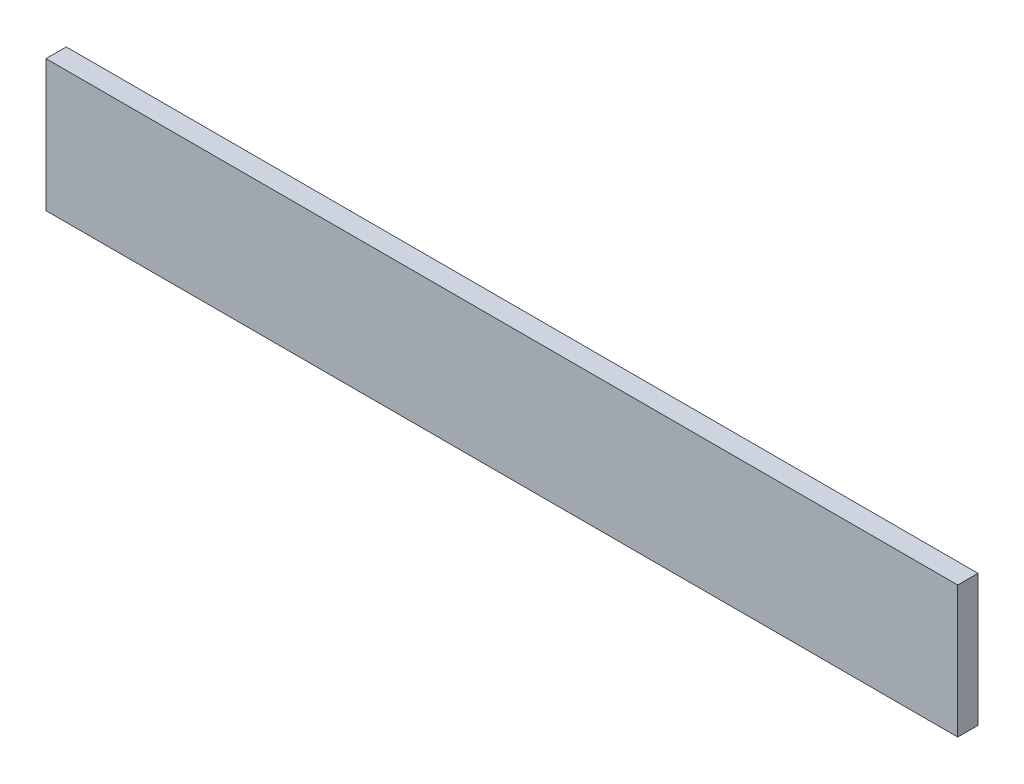
ISO-10303-21;
HEADER;
FILE_DESCRIPTION(('STEP AP214'),'2;1');
FILE_NAME('part.step','',(''),(''),'','','');
FILE_SCHEMA(('AUTOMOTIVE_DESIGN { 1 0 10303 214 1 1 1 1 }'));
ENDSEC;
DATA;
#1=APPLICATION_CONTEXT('core data for automotive mechanical design processes');
#2=APPLICATION_PROTOCOL_DEFINITION('international standard','automotive_design',2000,#1);
#3=PRODUCT_CONTEXT('',#1,'mechanical');
#4=PRODUCT('Part','Part','',(#3));
#5=PRODUCT_RELATED_PRODUCT_CATEGORY('part','',(#4));
#6=PRODUCT_DEFINITION_FORMATION('','',#4);
#7=PRODUCT_DEFINITION_CONTEXT('part definition',#1,'design');
#8=PRODUCT_DEFINITION('design','',#6,#7);
#9=PRODUCT_DEFINITION_SHAPE('','',#8);
#10=(LENGTH_UNIT() NAMED_UNIT(*) SI_UNIT(.MILLI.,.METRE.));
#11=(NAMED_UNIT(*) PLANE_ANGLE_UNIT() SI_UNIT($,.RADIAN.));
#12=(NAMED_UNIT(*) SI_UNIT($,.STERADIAN.) SOLID_ANGLE_UNIT());
#13=UNCERTAINTY_MEASURE_WITH_UNIT(LENGTH_MEASURE(1.E-05),#10,'distance_accuracy_value','');
#14=(GEOMETRIC_REPRESENTATION_CONTEXT(3) GLOBAL_UNCERTAINTY_ASSIGNED_CONTEXT((#13)) GLOBAL_UNIT_ASSIGNED_CONTEXT((#10,
#11,#12)) REPRESENTATION_CONTEXT('',''));
#15=CARTESIAN_POINT('',(0.,0.,0.));
#16=DIRECTION('',(0.,0.,1.));
#17=DIRECTION('',(1.,0.,0.));
#18=AXIS2_PLACEMENT_3D('',#15,#16,#17);
#19=CARTESIAN_POINT('',(0.,0.,10.));
#20=DIRECTION('',(1.,0.,0.));
#21=DIRECTION('',(0.,1.,0.));
#22=AXIS2_PLACEMENT_3D('',#19,#20,#21);
#23=PLANE('',#22);
#24=DIRECTION('',(0.,-1.,0.));
#25=VECTOR('',#24,1.);
#26=CARTESIAN_POINT('',(0.,0.,0.));
#27=LINE('',#26,#25);
#28=CARTESIAN_POINT('',(0.,65.,0.));
#29=VERTEX_POINT('',#28);
#30=CARTESIAN_POINT('',(0.,0.,0.));
#31=VERTEX_POINT('',#30);
#32=EDGE_CURVE('E96',#29,#31,#27,.T.);
#33=ORIENTED_EDGE('',*,*,#32,.T.);
#34=DIRECTION('',(0.,0.,-1.));
#35=VECTOR('',#34,1.);
#36=CARTESIAN_POINT('',(0.,0.,10.));
#37=LINE('',#36,#35);
#38=CARTESIAN_POINT('',(0.,0.,10.));
#39=VERTEX_POINT('',#38);
#40=EDGE_CURVE('E11',#39,#31,#37,.T.);
#41=ORIENTED_EDGE('',*,*,#40,.F.);
#42=DIRECTION('',(0.,-1.,0.));
#43=VECTOR('',#42,1.);
#44=CARTESIAN_POINT('',(0.,0.,10.));
#45=LINE('',#44,#43);
#46=CARTESIAN_POINT('',(0.,65.,10.));
#47=VERTEX_POINT('',#46);
#48=EDGE_CURVE('E84',#47,#39,#45,.T.);
#49=ORIENTED_EDGE('',*,*,#48,.F.);
#50=DIRECTION('',(0.,0.,-1.));
#51=VECTOR('',#50,1.);
#52=CARTESIAN_POINT('',(0.,65.,10.));
#53=LINE('',#52,#51);
#54=EDGE_CURVE('E92',#47,#29,#53,.T.);
#55=ORIENTED_EDGE('',*,*,#54,.T.);
#56=EDGE_LOOP('',(#33,#41,#49,#55));
#57=FACE_BOUND('',#56,.T.);
#58=ADVANCED_FACE('F33',(#57),#23,.F.);
#59=CARTESIAN_POINT('',(0.,0.,10.));
#60=DIRECTION('',(0.,1.,0.));
#61=DIRECTION('',(0.,0.,1.));
#62=AXIS2_PLACEMENT_3D('',#59,#60,#61);
#63=PLANE('',#62);
#64=DIRECTION('',(1.,0.,0.));
#65=VECTOR('',#64,1.);
#66=CARTESIAN_POINT('',(0.,0.,0.));
#67=LINE('',#66,#65);
#68=CARTESIAN_POINT('',(450.,0.,0.));
#69=VERTEX_POINT('',#68);
#70=EDGE_CURVE('E88',#31,#69,#67,.T.);
#71=ORIENTED_EDGE('',*,*,#70,.T.);
#72=DIRECTION('',(0.,0.,-1.));
#73=VECTOR('',#72,1.);
#74=CARTESIAN_POINT('',(450.,0.,10.));
#75=LINE('',#74,#73);
#76=CARTESIAN_POINT('',(450.,0.,10.));
#77=VERTEX_POINT('',#76);
#78=EDGE_CURVE('E41',#77,#69,#75,.T.);
#79=ORIENTED_EDGE('',*,*,#78,.F.);
#80=DIRECTION('',(1.,0.,0.));
#81=VECTOR('',#80,1.);
#82=CARTESIAN_POINT('',(0.,0.,10.));
#83=LINE('',#82,#81);
#84=EDGE_CURVE('E79',#39,#77,#83,.T.);
#85=ORIENTED_EDGE('',*,*,#84,.F.);
#86=ORIENTED_EDGE('',*,*,#40,.T.);
#87=EDGE_LOOP('',(#71,#79,#85,#86));
#88=FACE_BOUND('',#87,.T.);
#89=ADVANCED_FACE('F87',(#88),#63,.F.);
#90=CARTESIAN_POINT('',(450.,0.,10.));
#91=DIRECTION('',(-1.,0.,0.));
#92=DIRECTION('',(0.,0.,1.));
#93=AXIS2_PLACEMENT_3D('',#90,#91,#92);
#94=PLANE('',#93);
#95=DIRECTION('',(0.,1.,0.));
#96=VECTOR('',#95,1.);
#97=CARTESIAN_POINT('',(450.,0.,0.));
#98=LINE('',#97,#96);
#99=CARTESIAN_POINT('',(450.,65.,0.));
#100=VERTEX_POINT('',#99);
#101=EDGE_CURVE('E66',#69,#100,#98,.T.);
#102=ORIENTED_EDGE('',*,*,#101,.T.);
#103=DIRECTION('',(0.,0.,-1.));
#104=VECTOR('',#103,1.);
#105=CARTESIAN_POINT('',(450.,65.,10.));
#106=LINE('',#105,#104);
#107=CARTESIAN_POINT('',(450.,65.,10.));
#108=VERTEX_POINT('',#107);
#109=EDGE_CURVE('E89',#108,#100,#106,.T.);
#110=ORIENTED_EDGE('',*,*,#109,.F.);
#111=DIRECTION('',(0.,1.,0.));
#112=VECTOR('',#111,1.);
#113=CARTESIAN_POINT('',(450.,0.,10.));
#114=LINE('',#113,#112);
#115=EDGE_CURVE('E82',#77,#108,#114,.T.);
#116=ORIENTED_EDGE('',*,*,#115,.F.);
#117=ORIENTED_EDGE('',*,*,#78,.T.);
#118=EDGE_LOOP('',(#102,#110,#116,#117));
#119=FACE_BOUND('',#118,.T.);
#120=ADVANCED_FACE('F90',(#119),#94,.F.);
#121=CARTESIAN_POINT('',(0.,65.,10.));
#122=DIRECTION('',(0.,-1.,0.));
#123=DIRECTION('',(0.,0.,-1.));
#124=AXIS2_PLACEMENT_3D('',#121,#122,#123);
#125=PLANE('',#124);
#126=DIRECTION('',(-1.,0.,0.));
#127=VECTOR('',#126,1.);
#128=CARTESIAN_POINT('',(0.,65.,0.));
#129=LINE('',#128,#127);
#130=EDGE_CURVE('E72',#100,#29,#129,.T.);
#131=ORIENTED_EDGE('',*,*,#130,.T.);
#132=ORIENTED_EDGE('',*,*,#54,.F.);
#133=DIRECTION('',(-1.,0.,0.));
#134=VECTOR('',#133,1.);
#135=CARTESIAN_POINT('',(0.,65.,10.));
#136=LINE('',#135,#134);
#137=EDGE_CURVE('E49',#108,#47,#136,.T.);
#138=ORIENTED_EDGE('',*,*,#137,.F.);
#139=ORIENTED_EDGE('',*,*,#109,.T.);
#140=EDGE_LOOP('',(#131,#132,#138,#139));
#141=FACE_BOUND('',#140,.T.);
#142=ADVANCED_FACE('F103',(#141),#125,.F.);
#143=CARTESIAN_POINT('',(0.,0.,10.));
#144=DIRECTION('',(0.,0.,-1.));
#145=DIRECTION('',(-1.,0.,0.));
#146=AXIS2_PLACEMENT_3D('',#143,#144,#145);
#147=PLANE('',#146);
#148=ORIENTED_EDGE('',*,*,#48,.T.);
#149=ORIENTED_EDGE('',*,*,#84,.T.);
#150=ORIENTED_EDGE('',*,*,#115,.T.);
#151=ORIENTED_EDGE('',*,*,#137,.T.);
#152=EDGE_LOOP('',(#148,#149,#150,#151));
#153=FACE_BOUND('',#152,.T.);
#154=ADVANCED_FACE('F80',(#153),#147,.F.);
#155=CARTESIAN_POINT('',(0.,0.,0.));
#156=DIRECTION('',(0.,0.,-1.));
#157=DIRECTION('',(-1.,0.,0.));
#158=AXIS2_PLACEMENT_3D('',#155,#156,#157);
#159=PLANE('',#158);
#160=ORIENTED_EDGE('',*,*,#32,.F.);
#161=ORIENTED_EDGE('',*,*,#130,.F.);
#162=ORIENTED_EDGE('',*,*,#101,.F.);
#163=ORIENTED_EDGE('',*,*,#70,.F.);
#164=EDGE_LOOP('',(#160,#161,#162,#163));
#165=FACE_BOUND('',#164,.T.);
#166=ADVANCED_FACE('F106',(#165),#159,.T.);
#167=CLOSED_SHELL('',(#58,#89,#120,#142,#154,#166));
#168=MANIFOLD_SOLID_BREP('B2',#167);
#169=ADVANCED_BREP_SHAPE_REPRESENTATION('',(#18,#168),#14);
#170=SHAPE_DEFINITION_REPRESENTATION(#9,#169);
ENDSEC;
END-ISO-10303-21;
